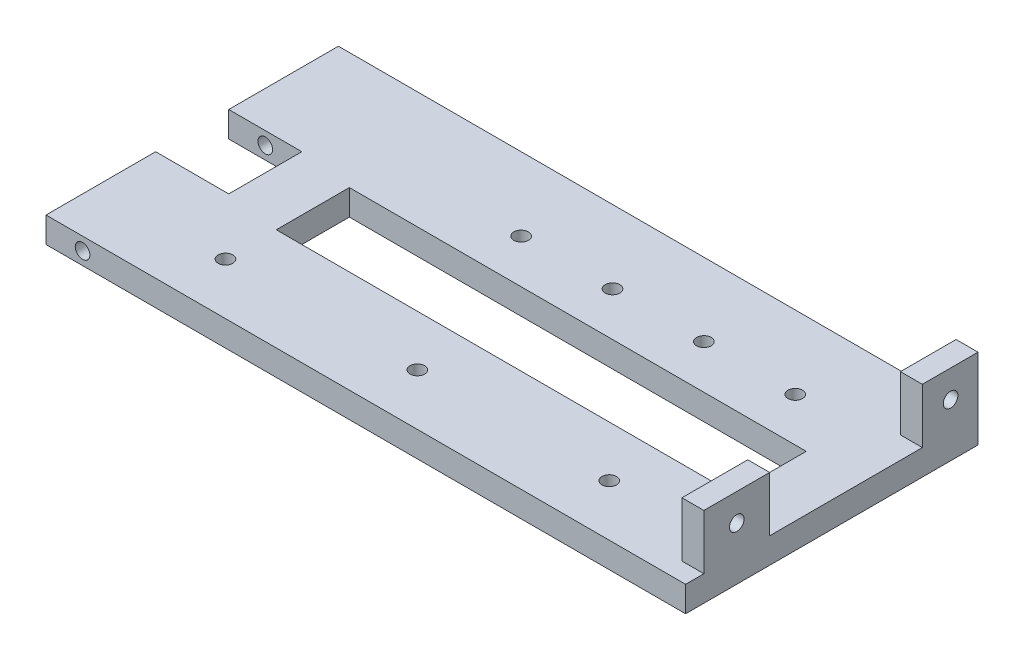
ISO-10303-21;
HEADER;
FILE_DESCRIPTION(('STEP AP214'),'2;1');
FILE_NAME('part.step','',(''),(''),'','','');
FILE_SCHEMA(('AUTOMOTIVE_DESIGN { 1 0 10303 214 1 1 1 1 }'));
ENDSEC;
DATA;
#1=APPLICATION_CONTEXT('core data for automotive mechanical design processes');
#2=APPLICATION_PROTOCOL_DEFINITION('international standard','automotive_design',2000,#1);
#3=PRODUCT_CONTEXT('',#1,'mechanical');
#4=PRODUCT('Part','Part','',(#3));
#5=PRODUCT_RELATED_PRODUCT_CATEGORY('part','',(#4));
#6=PRODUCT_DEFINITION_FORMATION('','',#4);
#7=PRODUCT_DEFINITION_CONTEXT('part definition',#1,'design');
#8=PRODUCT_DEFINITION('design','',#6,#7);
#9=PRODUCT_DEFINITION_SHAPE('','',#8);
#10=(LENGTH_UNIT() NAMED_UNIT(*) SI_UNIT(.MILLI.,.METRE.));
#11=(NAMED_UNIT(*) PLANE_ANGLE_UNIT() SI_UNIT($,.RADIAN.));
#12=(NAMED_UNIT(*) SI_UNIT($,.STERADIAN.) SOLID_ANGLE_UNIT());
#13=UNCERTAINTY_MEASURE_WITH_UNIT(LENGTH_MEASURE(1.E-05),#10,'distance_accuracy_value','');
#14=(GEOMETRIC_REPRESENTATION_CONTEXT(3) GLOBAL_UNCERTAINTY_ASSIGNED_CONTEXT((#13)) GLOBAL_UNIT_ASSIGNED_CONTEXT((#10,
#11,#12)) REPRESENTATION_CONTEXT('',''));
#15=CARTESIAN_POINT('',(0.,0.,0.));
#16=DIRECTION('',(0.,0.,1.));
#17=DIRECTION('',(1.,0.,0.));
#18=AXIS2_PLACEMENT_3D('',#15,#16,#17);
#19=CARTESIAN_POINT('',(-264.88344988345,7.,-33.006993006993));
#20=DIRECTION('',(1.,0.,0.));
#21=DIRECTION('',(0.,0.,1.));
#22=AXIS2_PLACEMENT_3D('',#19,#20,#21);
#23=PLANE('',#22);
#24=DIRECTION('',(0.,0.,-1.));
#25=VECTOR('',#24,1.);
#26=CARTESIAN_POINT('',(-264.88344988345,7.,-33.006993006993));
#27=LINE('',#26,#25);
#28=CARTESIAN_POINT('',(-264.88344988345,7.,-3.006993006993));
#29=VERTEX_POINT('',#28);
#30=CARTESIAN_POINT('',(-264.88344988345,7.,-33.006993006993));
#31=VERTEX_POINT('',#30);
#32=EDGE_CURVE('E326',#29,#31,#27,.T.);
#33=ORIENTED_EDGE('',*,*,#32,.T.);
#34=DIRECTION('',(0.,-1.,0.));
#35=VECTOR('',#34,1.);
#36=CARTESIAN_POINT('',(-264.88344988345,7.,-33.006993006993));
#37=LINE('',#36,#35);
#38=CARTESIAN_POINT('',(-264.88344988345,0.,-33.006993006993));
#39=VERTEX_POINT('',#38);
#40=EDGE_CURVE('E349',#31,#39,#37,.T.);
#41=ORIENTED_EDGE('',*,*,#40,.T.);
#42=DIRECTION('',(0.,0.,-1.));
#43=VECTOR('',#42,1.);
#44=CARTESIAN_POINT('',(-264.88344988345,0.,-33.006993006993));
#45=LINE('',#44,#43);
#46=CARTESIAN_POINT('',(-264.88344988345,0.,-3.006993006993));
#47=VERTEX_POINT('',#46);
#48=EDGE_CURVE('E341',#47,#39,#45,.T.);
#49=ORIENTED_EDGE('',*,*,#48,.F.);
#50=DIRECTION('',(0.,-1.,0.));
#51=VECTOR('',#50,1.);
#52=CARTESIAN_POINT('',(-264.88344988345,15.,-3.006993006993));
#53=LINE('',#52,#51);
#54=EDGE_CURVE('E218',#29,#47,#53,.T.);
#55=ORIENTED_EDGE('',*,*,#54,.F.);
#56=EDGE_LOOP('',(#33,#41,#49,#55));
#57=FACE_BOUND('',#56,.T.);
#58=ADVANCED_FACE('F34',(#57),#23,.F.);
#59=CARTESIAN_POINT('',(-179.7668997669,7.,0.));
#60=DIRECTION('',(0.,1.,0.));
#61=DIRECTION('',(0.,0.,1.));
#62=AXIS2_PLACEMENT_3D('',#59,#60,#61);
#63=PLANE('',#62);
#64=CARTESIAN_POINT('',(-119.88344988345,7.,-13.006993006993));
#65=DIRECTION('',(0.,-1.,0.));
#66=DIRECTION('',(0.,0.,1.));
#67=AXIS2_PLACEMENT_3D('',#64,#65,#66);
#68=CIRCLE('',#67,2.);
#69=CARTESIAN_POINT('',(-119.88344988345,7.,-11.006993006993));
#70=VERTEX_POINT('',#69);
#71=EDGE_CURVE('E367',#70,#70,#68,.T.);
#72=ORIENTED_EDGE('',*,*,#71,.T.);
#73=EDGE_LOOP('',(#72));
#74=FACE_BOUND('',#73,.T.);
#75=CARTESIAN_POINT('',(-144.88344988345,7.,-13.006993006993));
#76=DIRECTION('',(0.,-1.,0.));
#77=DIRECTION('',(0.,0.,1.));
#78=AXIS2_PLACEMENT_3D('',#75,#76,#77);
#79=CIRCLE('',#78,2.);
#80=CARTESIAN_POINT('',(-144.88344988345,7.,-11.006993006993));
#81=VERTEX_POINT('',#80);
#82=EDGE_CURVE('E688',#81,#81,#79,.T.);
#83=ORIENTED_EDGE('',*,*,#82,.T.);
#84=EDGE_LOOP('',(#83));
#85=FACE_BOUND('',#84,.T.);
#86=CARTESIAN_POINT('',(-169.88344988345,7.,-13.006993006993));
#87=DIRECTION('',(0.,-1.,0.));
#88=DIRECTION('',(0.,0.,1.));
#89=AXIS2_PLACEMENT_3D('',#86,#87,#88);
#90=CIRCLE('',#89,2.);
#91=CARTESIAN_POINT('',(-169.88344988345,7.,-11.006993006993));
#92=VERTEX_POINT('',#91);
#93=EDGE_CURVE('E691',#92,#92,#90,.T.);
#94=ORIENTED_EDGE('',*,*,#93,.T.);
#95=EDGE_LOOP('',(#94));
#96=FACE_BOUND('',#95,.T.);
#97=CARTESIAN_POINT('',(-194.88344988345,7.,-13.006993006993));
#98=DIRECTION('',(0.,-1.,0.));
#99=DIRECTION('',(0.,0.,1.));
#100=AXIS2_PLACEMENT_3D('',#97,#98,#99);
#101=CIRCLE('',#100,2.);
#102=CARTESIAN_POINT('',(-194.88344988345,7.,-11.006993006993));
#103=VERTEX_POINT('',#102);
#104=EDGE_CURVE('E198',#103,#103,#101,.T.);
#105=ORIENTED_EDGE('',*,*,#104,.T.);
#106=EDGE_LOOP('',(#105));
#107=FACE_BOUND('',#106,.T.);
#108=DIRECTION('',(1.,0.,0.));
#109=VECTOR('',#108,1.);
#110=CARTESIAN_POINT('',(-179.7668997669,7.,-3.00699300699301));
#111=LINE('',#110,#109);
#112=CARTESIAN_POINT('',(-244.88344988345,7.,-3.006993006993));
#113=VERTEX_POINT('',#112);
#114=EDGE_CURVE('E232',#29,#113,#111,.T.);
#115=ORIENTED_EDGE('',*,*,#114,.T.);
#116=DIRECTION('',(0.,0.,1.));
#117=VECTOR('',#116,1.);
#118=CARTESIAN_POINT('',(-244.88344988345,7.,0.));
#119=LINE('',#118,#117);
#120=CARTESIAN_POINT('',(-244.88344988345,7.,16.993006993007));
#121=VERTEX_POINT('',#120);
#122=EDGE_CURVE('E229',#113,#121,#119,.T.);
#123=ORIENTED_EDGE('',*,*,#122,.T.);
#124=DIRECTION('',(-1.,0.,0.));
#125=VECTOR('',#124,1.);
#126=CARTESIAN_POINT('',(-179.7668997669,7.,16.993006993007));
#127=LINE('',#126,#125);
#128=CARTESIAN_POINT('',(-264.88344988345,7.,16.993006993007));
#129=VERTEX_POINT('',#128);
#130=EDGE_CURVE('E221',#121,#129,#127,.T.);
#131=ORIENTED_EDGE('',*,*,#130,.T.);
#132=CARTESIAN_POINT('',(-264.88344988345,7.,46.993006993007));
#133=VERTEX_POINT('',#132);
#134=EDGE_CURVE('E327',#133,#129,#27,.T.);
#135=ORIENTED_EDGE('',*,*,#134,.F.);
#136=DIRECTION('',(-1.,0.,0.));
#137=VECTOR('',#136,1.);
#138=CARTESIAN_POINT('',(-89.8834498834499,7.,46.993006993007));
#139=LINE('',#138,#137);
#140=CARTESIAN_POINT('',(-89.8834498834499,7.,46.993006993007));
#141=VERTEX_POINT('',#140);
#142=EDGE_CURVE('E322',#141,#133,#139,.T.);
#143=ORIENTED_EDGE('',*,*,#142,.F.);
#144=DIRECTION('',(0.,0.,1.));
#145=VECTOR('',#144,1.);
#146=CARTESIAN_POINT('',(-89.8834498834499,7.,-33.006993006993));
#147=LINE('',#146,#145);
#148=CARTESIAN_POINT('',(-89.8834498834499,7.,41.993006993007));
#149=VERTEX_POINT('',#148);
#150=EDGE_CURVE('E323',#149,#141,#147,.T.);
#151=ORIENTED_EDGE('',*,*,#150,.F.);
#152=DIRECTION('',(-1.,0.,0.));
#153=VECTOR('',#152,1.);
#154=CARTESIAN_POINT('',(-89.8834498834499,7.,41.993006993007));
#155=LINE('',#154,#153);
#156=CARTESIAN_POINT('',(-95.8834498834499,7.,41.993006993007));
#157=VERTEX_POINT('',#156);
#158=EDGE_CURVE('E247',#149,#157,#155,.T.);
#159=ORIENTED_EDGE('',*,*,#158,.T.);
#160=DIRECTION('',(0.,0.,-1.));
#161=VECTOR('',#160,1.);
#162=CARTESIAN_POINT('',(-95.8834498834499,7.,41.993006993007));
#163=LINE('',#162,#161);
#164=CARTESIAN_POINT('',(-95.8834498834499,7.,23.993006993007));
#165=VERTEX_POINT('',#164);
#166=EDGE_CURVE('E263',#157,#165,#163,.T.);
#167=ORIENTED_EDGE('',*,*,#166,.T.);
#168=DIRECTION('',(1.,0.,0.));
#169=VECTOR('',#168,1.);
#170=CARTESIAN_POINT('',(-89.8834498834499,7.,23.993006993007));
#171=LINE('',#170,#169);
#172=CARTESIAN_POINT('',(-89.8834498834499,7.,23.993006993007));
#173=VERTEX_POINT('',#172);
#174=EDGE_CURVE('E252',#165,#173,#171,.T.);
#175=ORIENTED_EDGE('',*,*,#174,.T.);
#176=CARTESIAN_POINT('',(-89.8834498834499,7.,-17.7803002518982));
#177=VERTEX_POINT('',#176);
#178=EDGE_CURVE('E319',#177,#173,#147,.T.);
#179=ORIENTED_EDGE('',*,*,#178,.F.);
#180=DIRECTION('',(-1.,0.,0.));
#181=VECTOR('',#180,1.);
#182=CARTESIAN_POINT('',(-89.8834498834499,7.,-17.7803002518982));
#183=LINE('',#182,#181);
#184=CARTESIAN_POINT('',(-95.8834498834499,7.,-17.7803002518982));
#185=VERTEX_POINT('',#184);
#186=EDGE_CURVE('E275',#177,#185,#183,.T.);
#187=ORIENTED_EDGE('',*,*,#186,.T.);
#188=DIRECTION('',(0.,0.,-1.));
#189=VECTOR('',#188,1.);
#190=CARTESIAN_POINT('',(-95.8834498834499,7.,-33.006993006993));
#191=LINE('',#190,#189);
#192=CARTESIAN_POINT('',(-95.8834498834499,7.,-33.006993006993));
#193=VERTEX_POINT('',#192);
#194=EDGE_CURVE('E280',#185,#193,#191,.T.);
#195=ORIENTED_EDGE('',*,*,#194,.T.);
#196=DIRECTION('',(1.,0.,0.));
#197=VECTOR('',#196,1.);
#198=CARTESIAN_POINT('',(-89.8834498834499,7.,-33.006993006993));
#199=LINE('',#198,#197);
#200=EDGE_CURVE('E330',#31,#193,#199,.T.);
#201=ORIENTED_EDGE('',*,*,#200,.F.);
#202=ORIENTED_EDGE('',*,*,#32,.F.);
#203=EDGE_LOOP('',(#115,#123,#131,#135,#143,#151,#159,#167,#175,#179,#187,#195,#201,#202));
#204=FACE_BOUND('',#203,.T.);
#205=DIRECTION('',(0.,0.,-1.));
#206=VECTOR('',#205,1.);
#207=CARTESIAN_POINT('',(-229.88344988345,7.,18.993006993007));
#208=LINE('',#207,#206);
#209=CARTESIAN_POINT('',(-229.88344988345,7.,18.993006993007));
#210=VERTEX_POINT('',#209);
#211=CARTESIAN_POINT('',(-229.88344988345,7.,-1.006993006993));
#212=VERTEX_POINT('',#211);
#213=EDGE_CURVE('E297',#210,#212,#208,.T.);
#214=ORIENTED_EDGE('',*,*,#213,.T.);
#215=DIRECTION('',(1.,0.,0.));
#216=VECTOR('',#215,1.);
#217=CARTESIAN_POINT('',(-229.88344988345,7.,-1.006993006993));
#218=LINE('',#217,#216);
#219=CARTESIAN_POINT('',(-104.88344988345,7.,-1.00699300699298));
#220=VERTEX_POINT('',#219);
#221=EDGE_CURVE('E174',#212,#220,#218,.T.);
#222=ORIENTED_EDGE('',*,*,#221,.T.);
#223=DIRECTION('',(0.,0.,1.));
#224=VECTOR('',#223,1.);
#225=CARTESIAN_POINT('',(-104.88344988345,7.,18.993006993007));
#226=LINE('',#225,#224);
#227=CARTESIAN_POINT('',(-104.88344988345,7.,18.993006993007));
#228=VERTEX_POINT('',#227);
#229=EDGE_CURVE('E300',#220,#228,#226,.T.);
#230=ORIENTED_EDGE('',*,*,#229,.T.);
#231=DIRECTION('',(-1.,0.,0.));
#232=VECTOR('',#231,1.);
#233=CARTESIAN_POINT('',(-229.88344988345,7.,18.993006993007));
#234=LINE('',#233,#232);
#235=EDGE_CURVE('E178',#228,#210,#234,.T.);
#236=ORIENTED_EDGE('',*,*,#235,.T.);
#237=EDGE_LOOP('',(#214,#222,#230,#236));
#238=FACE_BOUND('',#237,.T.);
#239=CARTESIAN_POINT('',(-124.88344988345,7.,32.893006993007));
#240=DIRECTION('',(0.,-1.,0.));
#241=DIRECTION('',(0.,0.,1.));
#242=AXIS2_PLACEMENT_3D('',#239,#240,#241);
#243=CIRCLE('',#242,2.);
#244=CARTESIAN_POINT('',(-124.88344988345,7.,34.893006993007));
#245=VERTEX_POINT('',#244);
#246=EDGE_CURVE('E310',#245,#245,#243,.T.);
#247=ORIENTED_EDGE('',*,*,#246,.T.);
#248=EDGE_LOOP('',(#247));
#249=FACE_BOUND('',#248,.T.);
#250=CARTESIAN_POINT('',(-177.38344988345,7.,32.893006993007));
#251=DIRECTION('',(0.,-1.,0.));
#252=DIRECTION('',(0.,0.,1.));
#253=AXIS2_PLACEMENT_3D('',#250,#251,#252);
#254=CIRCLE('',#253,2.);
#255=CARTESIAN_POINT('',(-177.38344988345,7.,34.893006993007));
#256=VERTEX_POINT('',#255);
#257=EDGE_CURVE('E314',#256,#256,#254,.T.);
#258=ORIENTED_EDGE('',*,*,#257,.T.);
#259=EDGE_LOOP('',(#258));
#260=FACE_BOUND('',#259,.T.);
#261=CARTESIAN_POINT('',(-229.88344988345,7.,32.893006993007));
#262=DIRECTION('',(0.,-1.,0.));
#263=DIRECTION('',(0.,0.,1.));
#264=AXIS2_PLACEMENT_3D('',#261,#262,#263);
#265=CIRCLE('',#264,2.);
#266=CARTESIAN_POINT('',(-229.88344988345,7.,34.893006993007));
#267=VERTEX_POINT('',#266);
#268=EDGE_CURVE('E306',#267,#267,#265,.T.);
#269=ORIENTED_EDGE('',*,*,#268,.T.);
#270=EDGE_LOOP('',(#269));
#271=FACE_BOUND('',#270,.T.);
#272=ADVANCED_FACE('F402',(#74,#85,#96,#107,#204,#238,#249,#260,#271),#63,.T.);
#273=CARTESIAN_POINT('',(-89.8834498834499,7.,-33.006993006993));
#274=DIRECTION('',(-1.,0.,0.));
#275=DIRECTION('',(0.,0.,-1.));
#276=AXIS2_PLACEMENT_3D('',#273,#274,#275);
#277=PLANE('',#276);
#278=CARTESIAN_POINT('',(-89.8834498834499,14.5,-25.506993006993));
#279=DIRECTION('',(1.,0.,0.));
#280=DIRECTION('',(0.,0.,-1.));
#281=AXIS2_PLACEMENT_3D('',#278,#279,#280);
#282=CIRCLE('',#281,2.);
#283=CARTESIAN_POINT('',(-89.8834498834499,14.5,-27.506993006993));
#284=VERTEX_POINT('',#283);
#285=EDGE_CURVE('E244',#284,#284,#282,.T.);
#286=ORIENTED_EDGE('',*,*,#285,.F.);
#287=EDGE_LOOP('',(#286));
#288=FACE_BOUND('',#287,.T.);
#289=CARTESIAN_POINT('',(-89.8834498834499,14.5,32.993006993007));
#290=DIRECTION('',(1.,0.,0.));
#291=DIRECTION('',(0.,0.,-1.));
#292=AXIS2_PLACEMENT_3D('',#289,#290,#291);
#293=CIRCLE('',#292,2.);
#294=CARTESIAN_POINT('',(-89.8834498834499,14.5,30.993006993007));
#295=VERTEX_POINT('',#294);
#296=EDGE_CURVE('E239',#295,#295,#293,.T.);
#297=ORIENTED_EDGE('',*,*,#296,.F.);
#298=EDGE_LOOP('',(#297));
#299=FACE_BOUND('',#298,.T.);
#300=DIRECTION('',(0.,0.,1.));
#301=VECTOR('',#300,1.);
#302=CARTESIAN_POINT('',(-89.8834498834499,0.,-33.006993006993));
#303=LINE('',#302,#301);
#304=CARTESIAN_POINT('',(-89.8834498834499,0.,-33.006993006993));
#305=VERTEX_POINT('',#304);
#306=CARTESIAN_POINT('',(-89.8834498834499,0.,46.993006993007));
#307=VERTEX_POINT('',#306);
#308=EDGE_CURVE('E334',#305,#307,#303,.T.);
#309=ORIENTED_EDGE('',*,*,#308,.F.);
#310=DIRECTION('',(0.,-1.,0.));
#311=VECTOR('',#310,1.);
#312=CARTESIAN_POINT('',(-89.8834498834499,7.,-33.006993006993));
#313=LINE('',#312,#311);
#314=CARTESIAN_POINT('',(-89.8834498834499,22.,-33.006993006993));
#315=VERTEX_POINT('',#314);
#316=EDGE_CURVE('E333',#315,#305,#313,.T.);
#317=ORIENTED_EDGE('',*,*,#316,.F.);
#318=DIRECTION('',(0.,0.,1.));
#319=VECTOR('',#318,1.);
#320=CARTESIAN_POINT('',(-89.8834498834499,22.,-33.006993006993));
#321=LINE('',#320,#319);
#322=CARTESIAN_POINT('',(-89.8834498834499,22.,-17.7803002518982));
#323=VERTEX_POINT('',#322);
#324=EDGE_CURVE('E276',#315,#323,#321,.T.);
#325=ORIENTED_EDGE('',*,*,#324,.T.);
#326=DIRECTION('',(0.,-1.,0.));
#327=VECTOR('',#326,1.);
#328=CARTESIAN_POINT('',(-89.8834498834499,22.,-17.7803002518982));
#329=LINE('',#328,#327);
#330=EDGE_CURVE('E295',#323,#177,#329,.T.);
#331=ORIENTED_EDGE('',*,*,#330,.T.);
#332=ORIENTED_EDGE('',*,*,#178,.T.);
#333=DIRECTION('',(0.,-1.,0.));
#334=VECTOR('',#333,1.);
#335=CARTESIAN_POINT('',(-89.8834498834499,22.,23.993006993007));
#336=LINE('',#335,#334);
#337=CARTESIAN_POINT('',(-89.8834498834499,22.,23.993006993007));
#338=VERTEX_POINT('',#337);
#339=EDGE_CURVE('E260',#338,#173,#336,.T.);
#340=ORIENTED_EDGE('',*,*,#339,.F.);
#341=DIRECTION('',(0.,0.,1.));
#342=VECTOR('',#341,1.);
#343=CARTESIAN_POINT('',(-89.8834498834499,22.,41.993006993007));
#344=LINE('',#343,#342);
#345=CARTESIAN_POINT('',(-89.8834498834499,22.,41.993006993007));
#346=VERTEX_POINT('',#345);
#347=EDGE_CURVE('E248',#338,#346,#344,.T.);
#348=ORIENTED_EDGE('',*,*,#347,.T.);
#349=DIRECTION('',(0.,-1.,0.));
#350=VECTOR('',#349,1.);
#351=CARTESIAN_POINT('',(-89.8834498834499,22.,41.993006993007));
#352=LINE('',#351,#350);
#353=EDGE_CURVE('E273',#346,#149,#352,.T.);
#354=ORIENTED_EDGE('',*,*,#353,.T.);
#355=ORIENTED_EDGE('',*,*,#150,.T.);
#356=DIRECTION('',(0.,-1.,0.));
#357=VECTOR('',#356,1.);
#358=CARTESIAN_POINT('',(-89.8834498834499,7.,46.993006993007));
#359=LINE('',#358,#357);
#360=EDGE_CURVE('E12',#141,#307,#359,.T.);
#361=ORIENTED_EDGE('',*,*,#360,.T.);
#362=EDGE_LOOP('',(#309,#317,#325,#331,#332,#340,#348,#354,#355,#361));
#363=FACE_BOUND('',#362,.T.);
#364=ADVANCED_FACE('F36',(#288,#299,#363),#277,.F.);
#365=CARTESIAN_POINT('',(-89.8834498834499,7.,46.993006993007));
#366=DIRECTION('',(0.,0.,-1.));
#367=DIRECTION('',(1.,0.,0.));
#368=AXIS2_PLACEMENT_3D('',#365,#366,#367);
#369=PLANE('',#368);
#370=CARTESIAN_POINT('',(-254.88344988345,3.5,46.993006993007));
#371=DIRECTION('',(0.,0.,-1.));
#372=DIRECTION('',(-1.,0.,0.));
#373=AXIS2_PLACEMENT_3D('',#370,#371,#372);
#374=CIRCLE('',#373,2.);
#375=CARTESIAN_POINT('',(-256.88344988345,3.5,46.993006993007));
#376=VERTEX_POINT('',#375);
#377=EDGE_CURVE('E187',#376,#376,#374,.T.);
#378=ORIENTED_EDGE('',*,*,#377,.T.);
#379=EDGE_LOOP('',(#378));
#380=FACE_BOUND('',#379,.T.);
#381=DIRECTION('',(-1.,0.,0.));
#382=VECTOR('',#381,1.);
#383=CARTESIAN_POINT('',(-89.8834498834499,0.,46.993006993007));
#384=LINE('',#383,#382);
#385=CARTESIAN_POINT('',(-264.88344988345,0.,46.993006993007));
#386=VERTEX_POINT('',#385);
#387=EDGE_CURVE('E337',#307,#386,#384,.T.);
#388=ORIENTED_EDGE('',*,*,#387,.F.);
#389=ORIENTED_EDGE('',*,*,#360,.F.);
#390=ORIENTED_EDGE('',*,*,#142,.T.);
#391=DIRECTION('',(0.,-1.,0.));
#392=VECTOR('',#391,1.);
#393=CARTESIAN_POINT('',(-264.88344988345,7.,46.993006993007));
#394=LINE('',#393,#392);
#395=EDGE_CURVE('E43',#133,#386,#394,.T.);
#396=ORIENTED_EDGE('',*,*,#395,.T.);
#397=EDGE_LOOP('',(#388,#389,#390,#396));
#398=FACE_BOUND('',#397,.T.);
#399=ADVANCED_FACE('F414',(#380,#398),#369,.F.);
#400=CARTESIAN_POINT('',(-264.88344988345,0.,16.993006993007));
#401=VERTEX_POINT('',#400);
#402=EDGE_CURVE('E342',#386,#401,#45,.T.);
#403=ORIENTED_EDGE('',*,*,#402,.F.);
#404=ORIENTED_EDGE('',*,*,#395,.F.);
#405=ORIENTED_EDGE('',*,*,#134,.T.);
#406=DIRECTION('',(0.,-1.,0.));
#407=VECTOR('',#406,1.);
#408=CARTESIAN_POINT('',(-264.88344988345,15.,16.993006993007));
#409=LINE('',#408,#407);
#410=EDGE_CURVE('E217',#129,#401,#409,.T.);
#411=ORIENTED_EDGE('',*,*,#410,.T.);
#412=EDGE_LOOP('',(#403,#404,#405,#411));
#413=FACE_BOUND('',#412,.T.);
#414=ADVANCED_FACE('F405',(#413),#23,.F.);
#415=CARTESIAN_POINT('',(-89.8834498834499,7.,-33.006993006993));
#416=DIRECTION('',(0.,0.,1.));
#417=DIRECTION('',(-1.,0.,0.));
#418=AXIS2_PLACEMENT_3D('',#415,#416,#417);
#419=PLANE('',#418);
#420=CARTESIAN_POINT('',(-254.88344988345,3.5,-33.006993006993));
#421=DIRECTION('',(0.,0.,-1.));
#422=DIRECTION('',(-1.,0.,0.));
#423=AXIS2_PLACEMENT_3D('',#420,#421,#422);
#424=CIRCLE('',#423,2.);
#425=CARTESIAN_POINT('',(-256.88344988345,3.5,-33.006993006993));
#426=VERTEX_POINT('',#425);
#427=EDGE_CURVE('E204',#426,#426,#424,.T.);
#428=ORIENTED_EDGE('',*,*,#427,.F.);
#429=EDGE_LOOP('',(#428));
#430=FACE_BOUND('',#429,.T.);
#431=DIRECTION('',(1.,0.,0.));
#432=VECTOR('',#431,1.);
#433=CARTESIAN_POINT('',(-89.8834498834499,0.,-33.006993006993));
#434=LINE('',#433,#432);
#435=EDGE_CURVE('E345',#39,#305,#434,.T.);
#436=ORIENTED_EDGE('',*,*,#435,.F.);
#437=ORIENTED_EDGE('',*,*,#40,.F.);
#438=ORIENTED_EDGE('',*,*,#200,.T.);
#439=DIRECTION('',(0.,-1.,0.));
#440=VECTOR('',#439,1.);
#441=CARTESIAN_POINT('',(-95.8834498834499,22.,-33.006993006993));
#442=LINE('',#441,#440);
#443=CARTESIAN_POINT('',(-95.8834498834499,22.,-33.006993006993));
#444=VERTEX_POINT('',#443);
#445=EDGE_CURVE('E287',#444,#193,#442,.T.);
#446=ORIENTED_EDGE('',*,*,#445,.F.);
#447=DIRECTION('',(1.,0.,0.));
#448=VECTOR('',#447,1.);
#449=CARTESIAN_POINT('',(-89.8834498834499,22.,-33.006993006993));
#450=LINE('',#449,#448);
#451=EDGE_CURVE('E285',#444,#315,#450,.T.);
#452=ORIENTED_EDGE('',*,*,#451,.T.);
#453=ORIENTED_EDGE('',*,*,#316,.T.);
#454=EDGE_LOOP('',(#436,#437,#438,#446,#452,#453));
#455=FACE_BOUND('',#454,.T.);
#456=ADVANCED_FACE('F377',(#430,#455),#419,.F.);
#457=CARTESIAN_POINT('',(-179.7668997669,0.,0.));
#458=DIRECTION('',(0.,1.,0.));
#459=DIRECTION('',(0.,0.,1.));
#460=AXIS2_PLACEMENT_3D('',#457,#458,#459);
#461=PLANE('',#460);
#462=CARTESIAN_POINT('',(-119.88344988345,0.,-13.006993006993));
#463=DIRECTION('',(0.,-1.,0.));
#464=DIRECTION('',(0.,0.,1.));
#465=AXIS2_PLACEMENT_3D('',#462,#463,#464);
#466=CIRCLE('',#465,2.);
#467=CARTESIAN_POINT('',(-119.88344988345,0.,-11.006993006993));
#468=VERTEX_POINT('',#467);
#469=EDGE_CURVE('E38',#468,#468,#466,.T.);
#470=ORIENTED_EDGE('',*,*,#469,.F.);
#471=EDGE_LOOP('',(#470));
#472=FACE_BOUND('',#471,.T.);
#473=CARTESIAN_POINT('',(-144.88344988345,0.,-13.006993006993));
#474=DIRECTION('',(0.,-1.,0.));
#475=DIRECTION('',(0.,0.,1.));
#476=AXIS2_PLACEMENT_3D('',#473,#474,#475);
#477=CIRCLE('',#476,2.);
#478=CARTESIAN_POINT('',(-144.88344988345,0.,-11.006993006993));
#479=VERTEX_POINT('',#478);
#480=EDGE_CURVE('E196',#479,#479,#477,.T.);
#481=ORIENTED_EDGE('',*,*,#480,.F.);
#482=EDGE_LOOP('',(#481));
#483=FACE_BOUND('',#482,.T.);
#484=CARTESIAN_POINT('',(-169.88344988345,0.,-13.006993006993));
#485=DIRECTION('',(0.,-1.,0.));
#486=DIRECTION('',(0.,0.,1.));
#487=AXIS2_PLACEMENT_3D('',#484,#485,#486);
#488=CIRCLE('',#487,2.);
#489=CARTESIAN_POINT('',(-169.88344988345,0.,-11.006993006993));
#490=VERTEX_POINT('',#489);
#491=EDGE_CURVE('E366',#490,#490,#488,.T.);
#492=ORIENTED_EDGE('',*,*,#491,.F.);
#493=EDGE_LOOP('',(#492));
#494=FACE_BOUND('',#493,.T.);
#495=CARTESIAN_POINT('',(-194.88344988345,0.,-13.006993006993));
#496=DIRECTION('',(0.,-1.,0.));
#497=DIRECTION('',(0.,0.,1.));
#498=AXIS2_PLACEMENT_3D('',#495,#496,#497);
#499=CIRCLE('',#498,2.);
#500=CARTESIAN_POINT('',(-194.88344988345,0.,-11.006993006993));
#501=VERTEX_POINT('',#500);
#502=EDGE_CURVE('E363',#501,#501,#499,.T.);
#503=ORIENTED_EDGE('',*,*,#502,.F.);
#504=EDGE_LOOP('',(#503));
#505=FACE_BOUND('',#504,.T.);
#506=DIRECTION('',(-1.,0.,0.));
#507=VECTOR('',#506,1.);
#508=CARTESIAN_POINT('',(-179.7668997669,0.,18.993006993007));
#509=LINE('',#508,#507);
#510=CARTESIAN_POINT('',(-104.88344988345,0.,18.993006993007));
#511=VERTEX_POINT('',#510);
#512=CARTESIAN_POINT('',(-229.88344988345,0.,18.993006993007));
#513=VERTEX_POINT('',#512);
#514=EDGE_CURVE('E188',#511,#513,#509,.T.);
#515=ORIENTED_EDGE('',*,*,#514,.F.);
#516=DIRECTION('',(0.,0.,1.));
#517=VECTOR('',#516,1.);
#518=CARTESIAN_POINT('',(-104.88344988345,0.,0.));
#519=LINE('',#518,#517);
#520=CARTESIAN_POINT('',(-104.88344988345,0.,-1.00699300699298));
#521=VERTEX_POINT('',#520);
#522=EDGE_CURVE('E192',#521,#511,#519,.T.);
#523=ORIENTED_EDGE('',*,*,#522,.F.);
#524=DIRECTION('',(1.,0.,0.));
#525=VECTOR('',#524,1.);
#526=CARTESIAN_POINT('',(-179.7668997669,0.,-1.00699300699299));
#527=LINE('',#526,#525);
#528=CARTESIAN_POINT('',(-229.88344988345,0.,-1.006993006993));
#529=VERTEX_POINT('',#528);
#530=EDGE_CURVE('E171',#529,#521,#527,.T.);
#531=ORIENTED_EDGE('',*,*,#530,.F.);
#532=DIRECTION('',(0.,0.,-1.));
#533=VECTOR('',#532,1.);
#534=CARTESIAN_POINT('',(-229.88344988345,0.,0.));
#535=LINE('',#534,#533);
#536=EDGE_CURVE('E181',#513,#529,#535,.T.);
#537=ORIENTED_EDGE('',*,*,#536,.F.);
#538=EDGE_LOOP('',(#515,#523,#531,#537));
#539=FACE_BOUND('',#538,.T.);
#540=CARTESIAN_POINT('',(-124.88344988345,0.,32.893006993007));
#541=DIRECTION('',(0.,-1.,0.));
#542=DIRECTION('',(0.,0.,1.));
#543=AXIS2_PLACEMENT_3D('',#540,#541,#542);
#544=CIRCLE('',#543,2.);
#545=CARTESIAN_POINT('',(-124.88344988345,0.,34.893006993007));
#546=VERTEX_POINT('',#545);
#547=EDGE_CURVE('E338',#546,#546,#544,.T.);
#548=ORIENTED_EDGE('',*,*,#547,.F.);
#549=EDGE_LOOP('',(#548));
#550=FACE_BOUND('',#549,.T.);
#551=CARTESIAN_POINT('',(-177.38344988345,0.,32.893006993007));
#552=DIRECTION('',(0.,-1.,0.));
#553=DIRECTION('',(0.,0.,1.));
#554=AXIS2_PLACEMENT_3D('',#551,#552,#553);
#555=CIRCLE('',#554,2.);
#556=CARTESIAN_POINT('',(-177.38344988345,0.,34.893006993007));
#557=VERTEX_POINT('',#556);
#558=EDGE_CURVE('E356',#557,#557,#555,.T.);
#559=ORIENTED_EDGE('',*,*,#558,.F.);
#560=EDGE_LOOP('',(#559));
#561=FACE_BOUND('',#560,.T.);
#562=CARTESIAN_POINT('',(-229.88344988345,0.,32.893006993007));
#563=DIRECTION('',(0.,-1.,0.));
#564=DIRECTION('',(0.,0.,1.));
#565=AXIS2_PLACEMENT_3D('',#562,#563,#564);
#566=CIRCLE('',#565,2.);
#567=CARTESIAN_POINT('',(-229.88344988345,0.,34.893006993007));
#568=VERTEX_POINT('',#567);
#569=EDGE_CURVE('E313',#568,#568,#566,.T.);
#570=ORIENTED_EDGE('',*,*,#569,.F.);
#571=EDGE_LOOP('',(#570));
#572=FACE_BOUND('',#571,.T.);
#573=ORIENTED_EDGE('',*,*,#48,.T.);
#574=ORIENTED_EDGE('',*,*,#435,.T.);
#575=ORIENTED_EDGE('',*,*,#308,.T.);
#576=ORIENTED_EDGE('',*,*,#387,.T.);
#577=ORIENTED_EDGE('',*,*,#402,.T.);
#578=DIRECTION('',(1.,0.,0.));
#579=VECTOR('',#578,1.);
#580=CARTESIAN_POINT('',(-264.88344988345,0.,16.993006993007));
#581=LINE('',#580,#579);
#582=CARTESIAN_POINT('',(-244.88344988345,0.,16.993006993007));
#583=VERTEX_POINT('',#582);
#584=EDGE_CURVE('E59',#401,#583,#581,.T.);
#585=ORIENTED_EDGE('',*,*,#584,.T.);
#586=DIRECTION('',(0.,0.,-1.));
#587=VECTOR('',#586,1.);
#588=CARTESIAN_POINT('',(-244.88344988345,0.,16.993006993007));
#589=LINE('',#588,#587);
#590=CARTESIAN_POINT('',(-244.88344988345,0.,-3.006993006993));
#591=VERTEX_POINT('',#590);
#592=EDGE_CURVE('E212',#583,#591,#589,.T.);
#593=ORIENTED_EDGE('',*,*,#592,.T.);
#594=DIRECTION('',(-1.,0.,0.));
#595=VECTOR('',#594,1.);
#596=CARTESIAN_POINT('',(-264.88344988345,0.,-3.006993006993));
#597=LINE('',#596,#595);
#598=EDGE_CURVE('E215',#591,#47,#597,.T.);
#599=ORIENTED_EDGE('',*,*,#598,.T.);
#600=EDGE_LOOP('',(#573,#574,#575,#576,#577,#585,#593,#599));
#601=FACE_BOUND('',#600,.T.);
#602=ADVANCED_FACE('F190',(#472,#483,#494,#505,#539,#550,#561,#572,#601),#461,.F.);
#603=CARTESIAN_POINT('',(-229.88344988345,-3.,32.893006993007));
#604=DIRECTION('',(0.,1.,0.));
#605=DIRECTION('',(0.,0.,1.));
#606=AXIS2_PLACEMENT_3D('',#603,#604,#605);
#607=CYLINDRICAL_SURFACE('',#606,2.);
#608=ORIENTED_EDGE('',*,*,#268,.F.);
#609=EDGE_LOOP('',(#608));
#610=FACE_BOUND('',#609,.T.);
#611=ORIENTED_EDGE('',*,*,#569,.T.);
#612=EDGE_LOOP('',(#611));
#613=FACE_BOUND('',#612,.T.);
#614=ADVANCED_FACE('F376',(#610,#613),#607,.F.);
#615=CARTESIAN_POINT('',(-177.38344988345,-3.,32.893006993007));
#616=DIRECTION('',(0.,1.,0.));
#617=DIRECTION('',(0.,0.,1.));
#618=AXIS2_PLACEMENT_3D('',#615,#616,#617);
#619=CYLINDRICAL_SURFACE('',#618,2.);
#620=ORIENTED_EDGE('',*,*,#257,.F.);
#621=EDGE_LOOP('',(#620));
#622=FACE_BOUND('',#621,.T.);
#623=ORIENTED_EDGE('',*,*,#558,.T.);
#624=EDGE_LOOP('',(#623));
#625=FACE_BOUND('',#624,.T.);
#626=ADVANCED_FACE('F509',(#622,#625),#619,.F.);
#627=CARTESIAN_POINT('',(-124.88344988345,-3.,32.893006993007));
#628=DIRECTION('',(0.,1.,0.));
#629=DIRECTION('',(0.,0.,1.));
#630=AXIS2_PLACEMENT_3D('',#627,#628,#629);
#631=CYLINDRICAL_SURFACE('',#630,2.);
#632=ORIENTED_EDGE('',*,*,#246,.F.);
#633=EDGE_LOOP('',(#632));
#634=FACE_BOUND('',#633,.T.);
#635=ORIENTED_EDGE('',*,*,#547,.T.);
#636=EDGE_LOOP('',(#635));
#637=FACE_BOUND('',#636,.T.);
#638=ADVANCED_FACE('F506',(#634,#637),#631,.F.);
#639=CARTESIAN_POINT('',(-229.88344988345,6.,18.993006993007));
#640=DIRECTION('',(-1.,0.,0.));
#641=DIRECTION('',(0.,0.,-1.));
#642=AXIS2_PLACEMENT_3D('',#639,#640,#641);
#643=PLANE('',#642);
#644=ORIENTED_EDGE('',*,*,#213,.F.);
#645=DIRECTION('',(0.,1.,0.));
#646=VECTOR('',#645,1.);
#647=CARTESIAN_POINT('',(-229.88344988345,6.,18.993006993007));
#648=LINE('',#647,#646);
#649=EDGE_CURVE('E183',#513,#210,#648,.T.);
#650=ORIENTED_EDGE('',*,*,#649,.F.);
#651=ORIENTED_EDGE('',*,*,#536,.T.);
#652=DIRECTION('',(0.,1.,0.));
#653=VECTOR('',#652,1.);
#654=CARTESIAN_POINT('',(-229.88344988345,6.,-1.006993006993));
#655=LINE('',#654,#653);
#656=EDGE_CURVE('E167',#529,#212,#655,.T.);
#657=ORIENTED_EDGE('',*,*,#656,.T.);
#658=EDGE_LOOP('',(#644,#650,#651,#657));
#659=FACE_BOUND('',#658,.T.);
#660=ADVANCED_FACE('F182',(#659),#643,.F.);
#661=CARTESIAN_POINT('',(-229.88344988345,6.,18.993006993007));
#662=DIRECTION('',(0.,0.,1.));
#663=DIRECTION('',(-1.,0.,0.));
#664=AXIS2_PLACEMENT_3D('',#661,#662,#663);
#665=PLANE('',#664);
#666=ORIENTED_EDGE('',*,*,#235,.F.);
#667=DIRECTION('',(0.,1.,0.));
#668=VECTOR('',#667,1.);
#669=CARTESIAN_POINT('',(-104.88344988345,6.,18.993006993007));
#670=LINE('',#669,#668);
#671=EDGE_CURVE('E307',#511,#228,#670,.T.);
#672=ORIENTED_EDGE('',*,*,#671,.F.);
#673=ORIENTED_EDGE('',*,*,#514,.T.);
#674=ORIENTED_EDGE('',*,*,#649,.T.);
#675=EDGE_LOOP('',(#666,#672,#673,#674));
#676=FACE_BOUND('',#675,.T.);
#677=ADVANCED_FACE('F495',(#676),#665,.F.);
#678=CARTESIAN_POINT('',(-104.88344988345,6.,18.993006993007));
#679=DIRECTION('',(1.,0.,0.));
#680=DIRECTION('',(0.,0.,1.));
#681=AXIS2_PLACEMENT_3D('',#678,#679,#680);
#682=PLANE('',#681);
#683=ORIENTED_EDGE('',*,*,#229,.F.);
#684=DIRECTION('',(0.,1.,0.));
#685=VECTOR('',#684,1.);
#686=CARTESIAN_POINT('',(-104.88344988345,6.,-1.00699300699298));
#687=LINE('',#686,#685);
#688=EDGE_CURVE('E51',#521,#220,#687,.T.);
#689=ORIENTED_EDGE('',*,*,#688,.F.);
#690=ORIENTED_EDGE('',*,*,#522,.T.);
#691=ORIENTED_EDGE('',*,*,#671,.T.);
#692=EDGE_LOOP('',(#683,#689,#690,#691));
#693=FACE_BOUND('',#692,.T.);
#694=ADVANCED_FACE('F498',(#693),#682,.F.);
#695=CARTESIAN_POINT('',(-229.88344988345,6.,-1.006993006993));
#696=DIRECTION('',(0.,0.,-1.));
#697=DIRECTION('',(1.,0.,0.));
#698=AXIS2_PLACEMENT_3D('',#695,#696,#697);
#699=PLANE('',#698);
#700=ORIENTED_EDGE('',*,*,#221,.F.);
#701=ORIENTED_EDGE('',*,*,#656,.F.);
#702=ORIENTED_EDGE('',*,*,#530,.T.);
#703=ORIENTED_EDGE('',*,*,#688,.T.);
#704=EDGE_LOOP('',(#700,#701,#702,#703));
#705=FACE_BOUND('',#704,.T.);
#706=ADVANCED_FACE('F169',(#705),#699,.F.);
#707=CARTESIAN_POINT('',(-89.8834498834499,22.,-17.7803002518982));
#708=DIRECTION('',(0.,0.,-1.));
#709=DIRECTION('',(1.,0.,0.));
#710=AXIS2_PLACEMENT_3D('',#707,#708,#709);
#711=PLANE('',#710);
#712=ORIENTED_EDGE('',*,*,#186,.F.);
#713=ORIENTED_EDGE('',*,*,#330,.F.);
#714=DIRECTION('',(-1.,0.,0.));
#715=VECTOR('',#714,1.);
#716=CARTESIAN_POINT('',(-89.8834498834499,22.,-17.7803002518982));
#717=LINE('',#716,#715);
#718=CARTESIAN_POINT('',(-95.8834498834499,22.,-17.7803002518982));
#719=VERTEX_POINT('',#718);
#720=EDGE_CURVE('E279',#323,#719,#717,.T.);
#721=ORIENTED_EDGE('',*,*,#720,.T.);
#722=DIRECTION('',(0.,-1.,0.));
#723=VECTOR('',#722,1.);
#724=CARTESIAN_POINT('',(-95.8834498834499,22.,-17.7803002518982));
#725=LINE('',#724,#723);
#726=EDGE_CURVE('E293',#719,#185,#725,.T.);
#727=ORIENTED_EDGE('',*,*,#726,.T.);
#728=EDGE_LOOP('',(#712,#713,#721,#727));
#729=FACE_BOUND('',#728,.T.);
#730=ADVANCED_FACE('F460',(#729),#711,.F.);
#731=CARTESIAN_POINT('',(-95.8834498834499,22.,-33.006993006993));
#732=DIRECTION('',(1.,0.,0.));
#733=DIRECTION('',(0.,0.,1.));
#734=AXIS2_PLACEMENT_3D('',#731,#732,#733);
#735=PLANE('',#734);
#736=CARTESIAN_POINT('',(-95.8834498834499,14.5,-25.506993006993));
#737=DIRECTION('',(1.,0.,0.));
#738=DIRECTION('',(0.,0.,-1.));
#739=AXIS2_PLACEMENT_3D('',#736,#737,#738);
#740=CIRCLE('',#739,2.);
#741=CARTESIAN_POINT('',(-95.8834498834499,14.5,-27.506993006993));
#742=VERTEX_POINT('',#741);
#743=EDGE_CURVE('E236',#742,#742,#740,.T.);
#744=ORIENTED_EDGE('',*,*,#743,.T.);
#745=EDGE_LOOP('',(#744));
#746=FACE_BOUND('',#745,.T.);
#747=ORIENTED_EDGE('',*,*,#194,.F.);
#748=ORIENTED_EDGE('',*,*,#726,.F.);
#749=DIRECTION('',(0.,0.,-1.));
#750=VECTOR('',#749,1.);
#751=CARTESIAN_POINT('',(-95.8834498834499,22.,-33.006993006993));
#752=LINE('',#751,#750);
#753=EDGE_CURVE('E283',#719,#444,#752,.T.);
#754=ORIENTED_EDGE('',*,*,#753,.T.);
#755=ORIENTED_EDGE('',*,*,#445,.T.);
#756=EDGE_LOOP('',(#747,#748,#754,#755));
#757=FACE_BOUND('',#756,.T.);
#758=ADVANCED_FACE('F489',(#746,#757),#735,.F.);
#759=CARTESIAN_POINT('',(-179.7668997669,22.,0.));
#760=DIRECTION('',(0.,1.,0.));
#761=DIRECTION('',(0.,0.,1.));
#762=AXIS2_PLACEMENT_3D('',#759,#760,#761);
#763=PLANE('',#762);
#764=ORIENTED_EDGE('',*,*,#324,.F.);
#765=ORIENTED_EDGE('',*,*,#451,.F.);
#766=ORIENTED_EDGE('',*,*,#753,.F.);
#767=ORIENTED_EDGE('',*,*,#720,.F.);
#768=EDGE_LOOP('',(#764,#765,#766,#767));
#769=FACE_BOUND('',#768,.T.);
#770=ADVANCED_FACE('F454',(#769),#763,.T.);
#771=CARTESIAN_POINT('',(-89.8834498834499,22.,41.993006993007));
#772=DIRECTION('',(0.,0.,-1.));
#773=DIRECTION('',(1.,0.,0.));
#774=AXIS2_PLACEMENT_3D('',#771,#772,#773);
#775=PLANE('',#774);
#776=ORIENTED_EDGE('',*,*,#158,.F.);
#777=ORIENTED_EDGE('',*,*,#353,.F.);
#778=DIRECTION('',(-1.,0.,0.));
#779=VECTOR('',#778,1.);
#780=CARTESIAN_POINT('',(-89.8834498834499,22.,41.993006993007));
#781=LINE('',#780,#779);
#782=CARTESIAN_POINT('',(-95.8834498834499,22.,41.993006993007));
#783=VERTEX_POINT('',#782);
#784=EDGE_CURVE('E251',#346,#783,#781,.T.);
#785=ORIENTED_EDGE('',*,*,#784,.T.);
#786=DIRECTION('',(0.,-1.,0.));
#787=VECTOR('',#786,1.);
#788=CARTESIAN_POINT('',(-95.8834498834499,22.,41.993006993007));
#789=LINE('',#788,#787);
#790=EDGE_CURVE('E271',#783,#157,#789,.T.);
#791=ORIENTED_EDGE('',*,*,#790,.T.);
#792=EDGE_LOOP('',(#776,#777,#785,#791));
#793=FACE_BOUND('',#792,.T.);
#794=ADVANCED_FACE('F473',(#793),#775,.F.);
#795=CARTESIAN_POINT('',(-95.8834498834499,22.,41.993006993007));
#796=DIRECTION('',(1.,0.,0.));
#797=DIRECTION('',(0.,0.,1.));
#798=AXIS2_PLACEMENT_3D('',#795,#796,#797);
#799=PLANE('',#798);
#800=CARTESIAN_POINT('',(-95.8834498834499,14.5,32.993006993007));
#801=DIRECTION('',(1.,0.,0.));
#802=DIRECTION('',(0.,0.,-1.));
#803=AXIS2_PLACEMENT_3D('',#800,#801,#802);
#804=CIRCLE('',#803,2.);
#805=CARTESIAN_POINT('',(-95.8834498834499,14.5,30.993006993007));
#806=VERTEX_POINT('',#805);
#807=EDGE_CURVE('E235',#806,#806,#804,.T.);
#808=ORIENTED_EDGE('',*,*,#807,.T.);
#809=EDGE_LOOP('',(#808));
#810=FACE_BOUND('',#809,.T.);
#811=ORIENTED_EDGE('',*,*,#166,.F.);
#812=ORIENTED_EDGE('',*,*,#790,.F.);
#813=DIRECTION('',(0.,0.,-1.));
#814=VECTOR('',#813,1.);
#815=CARTESIAN_POINT('',(-95.8834498834499,22.,41.993006993007));
#816=LINE('',#815,#814);
#817=CARTESIAN_POINT('',(-95.8834498834499,22.,23.993006993007));
#818=VERTEX_POINT('',#817);
#819=EDGE_CURVE('E255',#783,#818,#816,.T.);
#820=ORIENTED_EDGE('',*,*,#819,.T.);
#821=DIRECTION('',(0.,-1.,0.));
#822=VECTOR('',#821,1.);
#823=CARTESIAN_POINT('',(-95.8834498834499,22.,23.993006993007));
#824=LINE('',#823,#822);
#825=EDGE_CURVE('E269',#818,#165,#824,.T.);
#826=ORIENTED_EDGE('',*,*,#825,.T.);
#827=EDGE_LOOP('',(#811,#812,#820,#826));
#828=FACE_BOUND('',#827,.T.);
#829=ADVANCED_FACE('F475',(#810,#828),#799,.F.);
#830=CARTESIAN_POINT('',(-89.8834498834499,22.,23.993006993007));
#831=DIRECTION('',(0.,0.,1.));
#832=DIRECTION('',(-1.,0.,0.));
#833=AXIS2_PLACEMENT_3D('',#830,#831,#832);
#834=PLANE('',#833);
#835=ORIENTED_EDGE('',*,*,#174,.F.);
#836=ORIENTED_EDGE('',*,*,#825,.F.);
#837=DIRECTION('',(1.,0.,0.));
#838=VECTOR('',#837,1.);
#839=CARTESIAN_POINT('',(-89.8834498834499,22.,23.993006993007));
#840=LINE('',#839,#838);
#841=EDGE_CURVE('E258',#818,#338,#840,.T.);
#842=ORIENTED_EDGE('',*,*,#841,.T.);
#843=ORIENTED_EDGE('',*,*,#339,.T.);
#844=EDGE_LOOP('',(#835,#836,#842,#843));
#845=FACE_BOUND('',#844,.T.);
#846=ADVANCED_FACE('F467',(#845),#834,.F.);
#847=CARTESIAN_POINT('',(-179.7668997669,22.,0.));
#848=DIRECTION('',(0.,-1.,0.));
#849=DIRECTION('',(0.,0.,-1.));
#850=AXIS2_PLACEMENT_3D('',#847,#848,#849);
#851=PLANE('',#850);
#852=ORIENTED_EDGE('',*,*,#347,.F.);
#853=ORIENTED_EDGE('',*,*,#841,.F.);
#854=ORIENTED_EDGE('',*,*,#819,.F.);
#855=ORIENTED_EDGE('',*,*,#784,.F.);
#856=EDGE_LOOP('',(#852,#853,#854,#855));
#857=FACE_BOUND('',#856,.T.);
#858=ADVANCED_FACE('F470',(#857),#851,.F.);
#859=CARTESIAN_POINT('',(-80.8834498834499,14.5,32.993006993007));
#860=DIRECTION('',(-1.,0.,0.));
#861=DIRECTION('',(0.,0.,-1.));
#862=AXIS2_PLACEMENT_3D('',#859,#860,#861);
#863=CYLINDRICAL_SURFACE('',#862,2.);
#864=ORIENTED_EDGE('',*,*,#807,.F.);
#865=EDGE_LOOP('',(#864));
#866=FACE_BOUND('',#865,.T.);
#867=ORIENTED_EDGE('',*,*,#296,.T.);
#868=EDGE_LOOP('',(#867));
#869=FACE_BOUND('',#868,.T.);
#870=ADVANCED_FACE('F595',(#866,#869),#863,.F.);
#871=CARTESIAN_POINT('',(-80.8834498834499,14.5,-25.506993006993));
#872=DIRECTION('',(-1.,0.,0.));
#873=DIRECTION('',(0.,0.,-1.));
#874=AXIS2_PLACEMENT_3D('',#871,#872,#873);
#875=CYLINDRICAL_SURFACE('',#874,2.);
#876=ORIENTED_EDGE('',*,*,#743,.F.);
#877=EDGE_LOOP('',(#876));
#878=FACE_BOUND('',#877,.T.);
#879=ORIENTED_EDGE('',*,*,#285,.T.);
#880=EDGE_LOOP('',(#879));
#881=FACE_BOUND('',#880,.T.);
#882=ADVANCED_FACE('F603',(#878,#881),#875,.F.);
#883=CARTESIAN_POINT('',(-264.88344988345,15.,-3.006993006993));
#884=DIRECTION('',(0.,0.,-1.));
#885=DIRECTION('',(1.,0.,0.));
#886=AXIS2_PLACEMENT_3D('',#883,#884,#885);
#887=PLANE('',#886);
#888=CARTESIAN_POINT('',(-254.88344988345,3.5,-3.006993006993));
#889=DIRECTION('',(0.,0.,1.));
#890=DIRECTION('',(1.,0.,0.));
#891=AXIS2_PLACEMENT_3D('',#888,#889,#890);
#892=CIRCLE('',#891,2.);
#893=CARTESIAN_POINT('',(-252.88344988345,3.5,-3.006993006993));
#894=VERTEX_POINT('',#893);
#895=EDGE_CURVE('E208',#894,#894,#892,.T.);
#896=ORIENTED_EDGE('',*,*,#895,.F.);
#897=EDGE_LOOP('',(#896));
#898=FACE_BOUND('',#897,.T.);
#899=ORIENTED_EDGE('',*,*,#114,.F.);
#900=ORIENTED_EDGE('',*,*,#54,.T.);
#901=ORIENTED_EDGE('',*,*,#598,.F.);
#902=DIRECTION('',(0.,-1.,0.));
#903=VECTOR('',#902,1.);
#904=CARTESIAN_POINT('',(-244.88344988345,15.,-3.006993006993));
#905=LINE('',#904,#903);
#906=EDGE_CURVE('E222',#113,#591,#905,.T.);
#907=ORIENTED_EDGE('',*,*,#906,.F.);
#908=EDGE_LOOP('',(#899,#900,#901,#907));
#909=FACE_BOUND('',#908,.T.);
#910=ADVANCED_FACE('F446',(#898,#909),#887,.F.);
#911=CARTESIAN_POINT('',(-244.88344988345,15.,16.993006993007));
#912=DIRECTION('',(1.,0.,0.));
#913=DIRECTION('',(0.,0.,1.));
#914=AXIS2_PLACEMENT_3D('',#911,#912,#913);
#915=PLANE('',#914);
#916=ORIENTED_EDGE('',*,*,#122,.F.);
#917=ORIENTED_EDGE('',*,*,#906,.T.);
#918=ORIENTED_EDGE('',*,*,#592,.F.);
#919=DIRECTION('',(0.,-1.,0.));
#920=VECTOR('',#919,1.);
#921=CARTESIAN_POINT('',(-244.88344988345,15.,16.993006993007));
#922=LINE('',#921,#920);
#923=EDGE_CURVE('E224',#121,#583,#922,.T.);
#924=ORIENTED_EDGE('',*,*,#923,.F.);
#925=EDGE_LOOP('',(#916,#917,#918,#924));
#926=FACE_BOUND('',#925,.T.);
#927=ADVANCED_FACE('F441',(#926),#915,.F.);
#928=CARTESIAN_POINT('',(-264.88344988345,15.,16.993006993007));
#929=DIRECTION('',(0.,0.,1.));
#930=DIRECTION('',(-1.,0.,0.));
#931=AXIS2_PLACEMENT_3D('',#928,#929,#930);
#932=PLANE('',#931);
#933=CARTESIAN_POINT('',(-254.88344988345,3.5,16.993006993007));
#934=DIRECTION('',(0.,0.,-1.));
#935=DIRECTION('',(-1.,0.,0.));
#936=AXIS2_PLACEMENT_3D('',#933,#934,#935);
#937=CIRCLE('',#936,2.);
#938=CARTESIAN_POINT('',(-256.88344988345,3.5,16.993006993007));
#939=VERTEX_POINT('',#938);
#940=EDGE_CURVE('E207',#939,#939,#937,.T.);
#941=ORIENTED_EDGE('',*,*,#940,.F.);
#942=EDGE_LOOP('',(#941));
#943=FACE_BOUND('',#942,.T.);
#944=ORIENTED_EDGE('',*,*,#130,.F.);
#945=ORIENTED_EDGE('',*,*,#923,.T.);
#946=ORIENTED_EDGE('',*,*,#584,.F.);
#947=ORIENTED_EDGE('',*,*,#410,.F.);
#948=EDGE_LOOP('',(#944,#945,#946,#947));
#949=FACE_BOUND('',#948,.T.);
#950=ADVANCED_FACE('F438',(#943,#949),#932,.F.);
#951=CARTESIAN_POINT('',(-254.88344988345,3.5,-33.006993006993));
#952=DIRECTION('',(0.,0.,1.));
#953=DIRECTION('',(-1.,0.,0.));
#954=AXIS2_PLACEMENT_3D('',#951,#952,#953);
#955=CYLINDRICAL_SURFACE('',#954,2.);
#956=ORIENTED_EDGE('',*,*,#377,.F.);
#957=EDGE_LOOP('',(#956));
#958=FACE_BOUND('',#957,.T.);
#959=ORIENTED_EDGE('',*,*,#940,.T.);
#960=EDGE_LOOP('',(#959));
#961=FACE_BOUND('',#960,.T.);
#962=ADVANCED_FACE('F397',(#958,#961),#955,.F.);
#963=ORIENTED_EDGE('',*,*,#427,.T.);
#964=EDGE_LOOP('',(#963));
#965=FACE_BOUND('',#964,.T.);
#966=ORIENTED_EDGE('',*,*,#895,.T.);
#967=EDGE_LOOP('',(#966));
#968=FACE_BOUND('',#967,.T.);
#969=ADVANCED_FACE('F387',(#965,#968),#955,.F.);
#970=CARTESIAN_POINT('',(-194.88344988345,-3.,-13.006993006993));
#971=DIRECTION('',(0.,1.,0.));
#972=DIRECTION('',(0.,0.,1.));
#973=AXIS2_PLACEMENT_3D('',#970,#971,#972);
#974=CYLINDRICAL_SURFACE('',#973,2.);
#975=ORIENTED_EDGE('',*,*,#104,.F.);
#976=EDGE_LOOP('',(#975));
#977=FACE_BOUND('',#976,.T.);
#978=ORIENTED_EDGE('',*,*,#502,.T.);
#979=EDGE_LOOP('',(#978));
#980=FACE_BOUND('',#979,.T.);
#981=ADVANCED_FACE('F384',(#977,#980),#974,.F.);
#982=CARTESIAN_POINT('',(-169.88344988345,-3.,-13.006993006993));
#983=DIRECTION('',(0.,1.,0.));
#984=DIRECTION('',(0.,0.,1.));
#985=AXIS2_PLACEMENT_3D('',#982,#983,#984);
#986=CYLINDRICAL_SURFACE('',#985,2.);
#987=ORIENTED_EDGE('',*,*,#93,.F.);
#988=EDGE_LOOP('',(#987));
#989=FACE_BOUND('',#988,.T.);
#990=ORIENTED_EDGE('',*,*,#491,.T.);
#991=EDGE_LOOP('',(#990));
#992=FACE_BOUND('',#991,.T.);
#993=ADVANCED_FACE('F386',(#989,#992),#986,.F.);
#994=CARTESIAN_POINT('',(-144.88344988345,-3.,-13.006993006993));
#995=DIRECTION('',(0.,1.,0.));
#996=DIRECTION('',(0.,0.,1.));
#997=AXIS2_PLACEMENT_3D('',#994,#995,#996);
#998=CYLINDRICAL_SURFACE('',#997,2.);
#999=ORIENTED_EDGE('',*,*,#82,.F.);
#1000=EDGE_LOOP('',(#999));
#1001=FACE_BOUND('',#1000,.T.);
#1002=ORIENTED_EDGE('',*,*,#480,.T.);
#1003=EDGE_LOOP('',(#1002));
#1004=FACE_BOUND('',#1003,.T.);
#1005=ADVANCED_FACE('F372',(#1001,#1004),#998,.F.);
#1006=CARTESIAN_POINT('',(-119.88344988345,-3.,-13.006993006993));
#1007=DIRECTION('',(0.,1.,0.));
#1008=DIRECTION('',(0.,0.,1.));
#1009=AXIS2_PLACEMENT_3D('',#1006,#1007,#1008);
#1010=CYLINDRICAL_SURFACE('',#1009,2.);
#1011=ORIENTED_EDGE('',*,*,#71,.F.);
#1012=EDGE_LOOP('',(#1011));
#1013=FACE_BOUND('',#1012,.T.);
#1014=ORIENTED_EDGE('',*,*,#469,.T.);
#1015=EDGE_LOOP('',(#1014));
#1016=FACE_BOUND('',#1015,.T.);
#1017=ADVANCED_FACE('F670',(#1013,#1016),#1010,.F.);
#1018=CLOSED_SHELL('',(#58,#272,#364,#399,#414,#456,#602,#614,#626,#638,#660,#677,#694,#706,
#730,#758,#770,#794,#829,#846,#858,#870,#882,#910,#927,#950,#962,#969,#981,#993,#1005,#1017));
#1019=MANIFOLD_SOLID_BREP('B2',#1018);
#1020=ADVANCED_BREP_SHAPE_REPRESENTATION('',(#18,#1019),#14);
#1021=SHAPE_DEFINITION_REPRESENTATION(#9,#1020);
ENDSEC;
END-ISO-10303-21;
